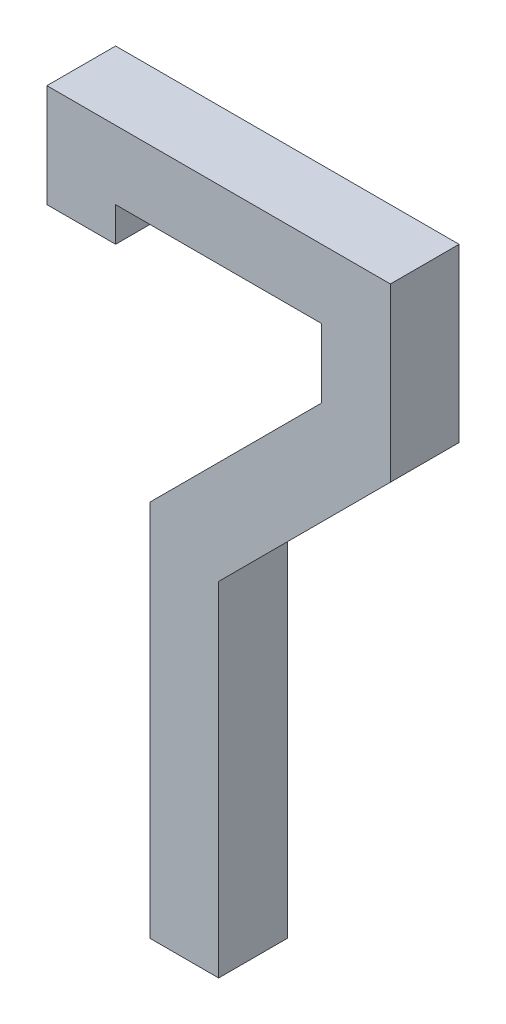
ISO-10303-21;
HEADER;
FILE_DESCRIPTION(('STEP AP214'),'2;1');
FILE_NAME('part.step','',(''),(''),'','','');
FILE_SCHEMA(('AUTOMOTIVE_DESIGN { 1 0 10303 214 1 1 1 1 }'));
ENDSEC;
DATA;
#1=APPLICATION_CONTEXT('core data for automotive mechanical design processes');
#2=APPLICATION_PROTOCOL_DEFINITION('international standard','automotive_design',2000,#1);
#3=PRODUCT_CONTEXT('',#1,'mechanical');
#4=PRODUCT('Part','Part','',(#3));
#5=PRODUCT_RELATED_PRODUCT_CATEGORY('part','',(#4));
#6=PRODUCT_DEFINITION_FORMATION('','',#4);
#7=PRODUCT_DEFINITION_CONTEXT('part definition',#1,'design');
#8=PRODUCT_DEFINITION('design','',#6,#7);
#9=PRODUCT_DEFINITION_SHAPE('','',#8);
#10=(LENGTH_UNIT() NAMED_UNIT(*) SI_UNIT(.MILLI.,.METRE.));
#11=(NAMED_UNIT(*) PLANE_ANGLE_UNIT() SI_UNIT($,.RADIAN.));
#12=(NAMED_UNIT(*) SI_UNIT($,.STERADIAN.) SOLID_ANGLE_UNIT());
#13=UNCERTAINTY_MEASURE_WITH_UNIT(LENGTH_MEASURE(1.E-05),#10,'distance_accuracy_value','');
#14=(GEOMETRIC_REPRESENTATION_CONTEXT(3) GLOBAL_UNCERTAINTY_ASSIGNED_CONTEXT((#13)) GLOBAL_UNIT_ASSIGNED_CONTEXT((#10,
#11,#12)) REPRESENTATION_CONTEXT('',''));
#15=CARTESIAN_POINT('',(0.,0.,0.));
#16=DIRECTION('',(0.,0.,1.));
#17=DIRECTION('',(1.,0.,0.));
#18=AXIS2_PLACEMENT_3D('',#15,#16,#17);
#19=CARTESIAN_POINT('',(-0.06349999999999,0.127,0.0254));
#20=DIRECTION('',(0.,0.,1.));
#21=DIRECTION('',(1.,0.,0.));
#22=AXIS2_PLACEMENT_3D('',#19,#20,#21);
#23=PLANE('',#22);
#24=DIRECTION('',(0.,1.,0.));
#25=VECTOR('',#24,1.);
#26=CARTESIAN_POINT('',(0.0635,0.127,0.0254));
#27=LINE('',#26,#25);
#28=CARTESIAN_POINT('',(0.0635,0.127,0.0254));
#29=VERTEX_POINT('',#28);
#30=CARTESIAN_POINT('',(0.0635,0.0635,0.0254));
#31=VERTEX_POINT('',#30);
#32=EDGE_CURVE('E157',#29,#31,#27,.F.);
#33=ORIENTED_EDGE('',*,*,#32,.F.);
#34=DIRECTION('',(1.,0.,0.));
#35=VECTOR('',#34,1.);
#36=CARTESIAN_POINT('',(-0.06349999999999,0.127,0.0254));
#37=LINE('',#36,#35);
#38=CARTESIAN_POINT('',(-0.06349999999999,0.127,0.0254));
#39=VERTEX_POINT('',#38);
#40=EDGE_CURVE('E118',#39,#29,#37,.T.);
#41=ORIENTED_EDGE('',*,*,#40,.F.);
#42=DIRECTION('',(0.,1.,0.));
#43=VECTOR('',#42,1.);
#44=CARTESIAN_POINT('',(-0.06349999999999,0.0889,0.0254));
#45=LINE('',#44,#43);
#46=CARTESIAN_POINT('',(-0.06349999999999,0.0889,0.0254));
#47=VERTEX_POINT('',#46);
#48=EDGE_CURVE('E20',#47,#39,#45,.T.);
#49=ORIENTED_EDGE('',*,*,#48,.F.);
#50=DIRECTION('',(1.,0.,0.));
#51=VECTOR('',#50,1.);
#52=CARTESIAN_POINT('',(-0.0381,0.0889,0.0254));
#53=LINE('',#52,#51);
#54=CARTESIAN_POINT('',(-0.0381,0.0889,0.0254));
#55=VERTEX_POINT('',#54);
#56=EDGE_CURVE('E107',#55,#47,#53,.F.);
#57=ORIENTED_EDGE('',*,*,#56,.F.);
#58=DIRECTION('',(0.,1.,0.));
#59=VECTOR('',#58,1.);
#60=CARTESIAN_POINT('',(-0.0381,0.1016,0.0254));
#61=LINE('',#60,#59);
#62=CARTESIAN_POINT('',(-0.0381,0.1016,0.0254));
#63=VERTEX_POINT('',#62);
#64=EDGE_CURVE('E102',#63,#55,#61,.F.);
#65=ORIENTED_EDGE('',*,*,#64,.F.);
#66=DIRECTION('',(1.,0.,0.));
#67=VECTOR('',#66,1.);
#68=CARTESIAN_POINT('',(0.0381,0.1016,0.0254));
#69=LINE('',#68,#67);
#70=CARTESIAN_POINT('',(0.0381,0.1016,0.0254));
#71=VERTEX_POINT('',#70);
#72=EDGE_CURVE('E129',#71,#63,#69,.F.);
#73=ORIENTED_EDGE('',*,*,#72,.F.);
#74=DIRECTION('',(0.,1.,0.));
#75=VECTOR('',#74,1.);
#76=CARTESIAN_POINT('',(0.0381,0.0762,0.0254));
#77=LINE('',#76,#75);
#78=CARTESIAN_POINT('',(0.03809999999999,0.07620000000001,0.0254));
#79=VERTEX_POINT('',#78);
#80=EDGE_CURVE('E133',#79,#71,#77,.T.);
#81=ORIENTED_EDGE('',*,*,#80,.F.);
#82=DIRECTION('',(-0.707106781186048,-0.707106781187048,0.));
#83=VECTOR('',#82,1.);
#84=CARTESIAN_POINT('',(-0.02539999999999,0.0127,0.0254));
#85=LINE('',#84,#83);
#86=CARTESIAN_POINT('',(-0.02539999999999,0.0127,0.0254));
#87=VERTEX_POINT('',#86);
#88=EDGE_CURVE('E137',#87,#79,#85,.F.);
#89=ORIENTED_EDGE('',*,*,#88,.F.);
#90=DIRECTION('',(0.,1.,0.));
#91=VECTOR('',#90,1.);
#92=CARTESIAN_POINT('',(-0.02539999999999,-0.127,0.0254));
#93=LINE('',#92,#91);
#94=CARTESIAN_POINT('',(-0.02539999999999,-0.127,0.0254));
#95=VERTEX_POINT('',#94);
#96=EDGE_CURVE('E141',#95,#87,#93,.T.);
#97=ORIENTED_EDGE('',*,*,#96,.F.);
#98=DIRECTION('',(1.,0.,0.));
#99=VECTOR('',#98,1.);
#100=CARTESIAN_POINT('',(0.,-0.127,0.0254));
#101=LINE('',#100,#99);
#102=CARTESIAN_POINT('',(0.,-0.127,0.0254));
#103=VERTEX_POINT('',#102);
#104=EDGE_CURVE('E145',#103,#95,#101,.F.);
#105=ORIENTED_EDGE('',*,*,#104,.F.);
#106=DIRECTION('',(0.,1.,0.));
#107=VECTOR('',#106,1.);
#108=CARTESIAN_POINT('',(0.,0.,0.0254));
#109=LINE('',#108,#107);
#110=CARTESIAN_POINT('',(0.,0.,0.0254));
#111=VERTEX_POINT('',#110);
#112=EDGE_CURVE('E149',#111,#103,#109,.F.);
#113=ORIENTED_EDGE('',*,*,#112,.F.);
#114=DIRECTION('',(0.707106781186548,0.707106781186548,0.));
#115=VECTOR('',#114,1.);
#116=CARTESIAN_POINT('',(0.0635,0.0635,0.0254));
#117=LINE('',#116,#115);
#118=EDGE_CURVE('E153',#31,#111,#117,.F.);
#119=ORIENTED_EDGE('',*,*,#118,.F.);
#120=EDGE_LOOP('',(#33,#41,#49,#57,#65,#73,#81,#89,#97,#105,#113,#119));
#121=FACE_BOUND('',#120,.T.);
#122=ADVANCED_FACE('F17',(#121),#23,.T.);
#123=CARTESIAN_POINT('',(-0.06349999999999,0.0889,0.));
#124=DIRECTION('',(-1.,0.,0.));
#125=DIRECTION('',(0.,0.,1.));
#126=AXIS2_PLACEMENT_3D('',#123,#124,#125);
#127=PLANE('',#126);
#128=DIRECTION('',(0.,0.,1.));
#129=VECTOR('',#128,1.);
#130=CARTESIAN_POINT('',(-0.06349999999999,0.127,0.));
#131=LINE('',#130,#129);
#132=CARTESIAN_POINT('',(-0.06349999999999,0.127,0.));
#133=VERTEX_POINT('',#132);
#134=EDGE_CURVE('E161',#133,#39,#131,.T.);
#135=ORIENTED_EDGE('',*,*,#134,.F.);
#136=DIRECTION('',(0.,1.,0.));
#137=VECTOR('',#136,1.);
#138=CARTESIAN_POINT('',(-0.06349999999999,0.127,0.));
#139=LINE('',#138,#137);
#140=CARTESIAN_POINT('',(-0.06349999999999,0.0889,0.));
#141=VERTEX_POINT('',#140);
#142=EDGE_CURVE('E124',#133,#141,#139,.F.);
#143=ORIENTED_EDGE('',*,*,#142,.T.);
#144=DIRECTION('',(0.,0.,-1.));
#145=VECTOR('',#144,1.);
#146=CARTESIAN_POINT('',(-0.06349999999999,0.0889,0.));
#147=LINE('',#146,#145);
#148=EDGE_CURVE('E112',#47,#141,#147,.T.);
#149=ORIENTED_EDGE('',*,*,#148,.F.);
#150=ORIENTED_EDGE('',*,*,#48,.T.);
#151=EDGE_LOOP('',(#135,#143,#149,#150));
#152=FACE_BOUND('',#151,.T.);
#153=ADVANCED_FACE('F123',(#152),#127,.T.);
#154=CARTESIAN_POINT('',(-0.0381,0.0889,0.));
#155=DIRECTION('',(0.,-1.,0.));
#156=DIRECTION('',(0.,0.,-1.));
#157=AXIS2_PLACEMENT_3D('',#154,#155,#156);
#158=PLANE('',#157);
#159=ORIENTED_EDGE('',*,*,#148,.T.);
#160=DIRECTION('',(1.,0.,0.));
#161=VECTOR('',#160,1.);
#162=CARTESIAN_POINT('',(-0.06349999999999,0.0889,0.));
#163=LINE('',#162,#161);
#164=CARTESIAN_POINT('',(-0.0381,0.0889,0.));
#165=VERTEX_POINT('',#164);
#166=EDGE_CURVE('E166',#141,#165,#163,.T.);
#167=ORIENTED_EDGE('',*,*,#166,.T.);
#168=DIRECTION('',(0.,0.,-1.));
#169=VECTOR('',#168,1.);
#170=CARTESIAN_POINT('',(-0.0381,0.0889,0.));
#171=LINE('',#170,#169);
#172=EDGE_CURVE('E114',#55,#165,#171,.T.);
#173=ORIENTED_EDGE('',*,*,#172,.F.);
#174=ORIENTED_EDGE('',*,*,#56,.T.);
#175=EDGE_LOOP('',(#159,#167,#173,#174));
#176=FACE_BOUND('',#175,.T.);
#177=ADVANCED_FACE('F109',(#176),#158,.T.);
#178=CARTESIAN_POINT('',(-0.0381,0.1016,0.));
#179=DIRECTION('',(1.,0.,0.));
#180=DIRECTION('',(0.,0.,-1.));
#181=AXIS2_PLACEMENT_3D('',#178,#179,#180);
#182=PLANE('',#181);
#183=ORIENTED_EDGE('',*,*,#172,.T.);
#184=DIRECTION('',(0.,1.,0.));
#185=VECTOR('',#184,1.);
#186=CARTESIAN_POINT('',(-0.0381,0.127,0.));
#187=LINE('',#186,#185);
#188=CARTESIAN_POINT('',(-0.0381,0.1016,0.));
#189=VERTEX_POINT('',#188);
#190=EDGE_CURVE('E168',#165,#189,#187,.T.);
#191=ORIENTED_EDGE('',*,*,#190,.T.);
#192=DIRECTION('',(0.,0.,-1.));
#193=VECTOR('',#192,1.);
#194=CARTESIAN_POINT('',(-0.0381,0.1016,0.));
#195=LINE('',#194,#193);
#196=EDGE_CURVE('E131',#63,#189,#195,.T.);
#197=ORIENTED_EDGE('',*,*,#196,.F.);
#198=ORIENTED_EDGE('',*,*,#64,.T.);
#199=EDGE_LOOP('',(#183,#191,#197,#198));
#200=FACE_BOUND('',#199,.T.);
#201=ADVANCED_FACE('F234',(#200),#182,.T.);
#202=CARTESIAN_POINT('',(0.0381,0.1016,0.));
#203=DIRECTION('',(0.,-1.,0.));
#204=DIRECTION('',(0.,0.,-1.));
#205=AXIS2_PLACEMENT_3D('',#202,#203,#204);
#206=PLANE('',#205);
#207=ORIENTED_EDGE('',*,*,#196,.T.);
#208=DIRECTION('',(1.,0.,0.));
#209=VECTOR('',#208,1.);
#210=CARTESIAN_POINT('',(-0.06349999999999,0.1016,0.));
#211=LINE('',#210,#209);
#212=CARTESIAN_POINT('',(0.0381,0.1016,0.));
#213=VERTEX_POINT('',#212);
#214=EDGE_CURVE('E171',#189,#213,#211,.T.);
#215=ORIENTED_EDGE('',*,*,#214,.T.);
#216=DIRECTION('',(0.,0.,1.));
#217=VECTOR('',#216,1.);
#218=CARTESIAN_POINT('',(0.0381,0.1016,0.));
#219=LINE('',#218,#217);
#220=EDGE_CURVE('E135',#71,#213,#219,.F.);
#221=ORIENTED_EDGE('',*,*,#220,.F.);
#222=ORIENTED_EDGE('',*,*,#72,.T.);
#223=EDGE_LOOP('',(#207,#215,#221,#222));
#224=FACE_BOUND('',#223,.T.);
#225=ADVANCED_FACE('F233',(#224),#206,.T.);
#226=CARTESIAN_POINT('',(0.0381,0.0762,0.));
#227=DIRECTION('',(-1.,0.,0.));
#228=DIRECTION('',(0.,0.,1.));
#229=AXIS2_PLACEMENT_3D('',#226,#227,#228);
#230=PLANE('',#229);
#231=ORIENTED_EDGE('',*,*,#220,.T.);
#232=DIRECTION('',(0.,1.,0.));
#233=VECTOR('',#232,1.);
#234=CARTESIAN_POINT('',(0.0381,0.127,0.));
#235=LINE('',#234,#233);
#236=CARTESIAN_POINT('',(0.03809999999999,0.07620000000001,0.));
#237=VERTEX_POINT('',#236);
#238=EDGE_CURVE('E174',#213,#237,#235,.F.);
#239=ORIENTED_EDGE('',*,*,#238,.T.);
#240=DIRECTION('',(0.,0.,1.));
#241=VECTOR('',#240,1.);
#242=CARTESIAN_POINT('',(0.0380999999999601,0.0762000000000399,0.));
#243=LINE('',#242,#241);
#244=EDGE_CURVE('E139',#79,#237,#243,.F.);
#245=ORIENTED_EDGE('',*,*,#244,.F.);
#246=ORIENTED_EDGE('',*,*,#80,.T.);
#247=EDGE_LOOP('',(#231,#239,#245,#246));
#248=FACE_BOUND('',#247,.T.);
#249=ADVANCED_FACE('F227',(#248),#230,.T.);
#250=CARTESIAN_POINT('',(-0.02539999999999,0.0127,0.));
#251=DIRECTION('',(-0.707106781187048,0.707106781186048,0.));
#252=DIRECTION('',(-0.707106781186048,-0.707106781187048,0.));
#253=AXIS2_PLACEMENT_3D('',#250,#251,#252);
#254=PLANE('',#253);
#255=ORIENTED_EDGE('',*,*,#244,.T.);
#256=DIRECTION('',(-0.707106781186492,-0.707106781186603,0.));
#257=VECTOR('',#256,1.);
#258=CARTESIAN_POINT('',(0.0381,0.0762,0.));
#259=LINE('',#258,#257);
#260=CARTESIAN_POINT('',(-0.02539999999999,0.0127,0.));
#261=VERTEX_POINT('',#260);
#262=EDGE_CURVE('E177',#237,#261,#259,.T.);
#263=ORIENTED_EDGE('',*,*,#262,.T.);
#264=DIRECTION('',(0.,0.,1.));
#265=VECTOR('',#264,1.);
#266=CARTESIAN_POINT('',(-0.02539999999999,0.0127,0.));
#267=LINE('',#266,#265);
#268=EDGE_CURVE('E143',#87,#261,#267,.F.);
#269=ORIENTED_EDGE('',*,*,#268,.F.);
#270=ORIENTED_EDGE('',*,*,#88,.T.);
#271=EDGE_LOOP('',(#255,#263,#269,#270));
#272=FACE_BOUND('',#271,.T.);
#273=ADVANCED_FACE('F223',(#272),#254,.T.);
#274=CARTESIAN_POINT('',(-0.02539999999999,-0.127,0.));
#275=DIRECTION('',(-1.,0.,0.));
#276=DIRECTION('',(0.,0.,1.));
#277=AXIS2_PLACEMENT_3D('',#274,#275,#276);
#278=PLANE('',#277);
#279=ORIENTED_EDGE('',*,*,#268,.T.);
#280=DIRECTION('',(0.,1.,0.));
#281=VECTOR('',#280,1.);
#282=CARTESIAN_POINT('',(-0.02539999999999,0.127,0.));
#283=LINE('',#282,#281);
#284=CARTESIAN_POINT('',(-0.02539999999999,-0.127,0.));
#285=VERTEX_POINT('',#284);
#286=EDGE_CURVE('E180',#261,#285,#283,.F.);
#287=ORIENTED_EDGE('',*,*,#286,.T.);
#288=DIRECTION('',(0.,0.,-1.));
#289=VECTOR('',#288,1.);
#290=CARTESIAN_POINT('',(-0.02539999999999,-0.127,0.));
#291=LINE('',#290,#289);
#292=EDGE_CURVE('E147',#95,#285,#291,.T.);
#293=ORIENTED_EDGE('',*,*,#292,.F.);
#294=ORIENTED_EDGE('',*,*,#96,.T.);
#295=EDGE_LOOP('',(#279,#287,#293,#294));
#296=FACE_BOUND('',#295,.T.);
#297=ADVANCED_FACE('F217',(#296),#278,.T.);
#298=CARTESIAN_POINT('',(0.,-0.127,0.));
#299=DIRECTION('',(0.,-1.,0.));
#300=DIRECTION('',(0.,0.,-1.));
#301=AXIS2_PLACEMENT_3D('',#298,#299,#300);
#302=PLANE('',#301);
#303=ORIENTED_EDGE('',*,*,#292,.T.);
#304=DIRECTION('',(1.,0.,0.));
#305=VECTOR('',#304,1.);
#306=CARTESIAN_POINT('',(-0.06349999999999,-0.127,0.));
#307=LINE('',#306,#305);
#308=CARTESIAN_POINT('',(0.,-0.127,0.));
#309=VERTEX_POINT('',#308);
#310=EDGE_CURVE('E183',#285,#309,#307,.T.);
#311=ORIENTED_EDGE('',*,*,#310,.T.);
#312=DIRECTION('',(0.,0.,-1.));
#313=VECTOR('',#312,1.);
#314=CARTESIAN_POINT('',(0.,-0.127,0.));
#315=LINE('',#314,#313);
#316=EDGE_CURVE('E151',#103,#309,#315,.T.);
#317=ORIENTED_EDGE('',*,*,#316,.F.);
#318=ORIENTED_EDGE('',*,*,#104,.T.);
#319=EDGE_LOOP('',(#303,#311,#317,#318));
#320=FACE_BOUND('',#319,.T.);
#321=ADVANCED_FACE('F213',(#320),#302,.T.);
#322=CARTESIAN_POINT('',(0.,0.,0.));
#323=DIRECTION('',(1.,0.,0.));
#324=DIRECTION('',(0.,0.,-1.));
#325=AXIS2_PLACEMENT_3D('',#322,#323,#324);
#326=PLANE('',#325);
#327=ORIENTED_EDGE('',*,*,#316,.T.);
#328=DIRECTION('',(0.,1.,0.));
#329=VECTOR('',#328,1.);
#330=CARTESIAN_POINT('',(0.,0.127,0.));
#331=LINE('',#330,#329);
#332=CARTESIAN_POINT('',(0.,0.,0.));
#333=VERTEX_POINT('',#332);
#334=EDGE_CURVE('E186',#309,#333,#331,.T.);
#335=ORIENTED_EDGE('',*,*,#334,.T.);
#336=DIRECTION('',(0.,0.,1.));
#337=VECTOR('',#336,1.);
#338=CARTESIAN_POINT('',(0.,0.,0.));
#339=LINE('',#338,#337);
#340=EDGE_CURVE('E155',#111,#333,#339,.F.);
#341=ORIENTED_EDGE('',*,*,#340,.F.);
#342=ORIENTED_EDGE('',*,*,#112,.T.);
#343=EDGE_LOOP('',(#327,#335,#341,#342));
#344=FACE_BOUND('',#343,.T.);
#345=ADVANCED_FACE('F207',(#344),#326,.T.);
#346=CARTESIAN_POINT('',(0.0635,0.0635,0.));
#347=DIRECTION('',(0.707106781186548,-0.707106781186548,0.));
#348=DIRECTION('',(0.707106781186548,0.707106781186548,0.));
#349=AXIS2_PLACEMENT_3D('',#346,#347,#348);
#350=PLANE('',#349);
#351=ORIENTED_EDGE('',*,*,#340,.T.);
#352=DIRECTION('',(0.707106781186548,0.707106781186548,0.));
#353=VECTOR('',#352,1.);
#354=CARTESIAN_POINT('',(0.,0.,0.));
#355=LINE('',#354,#353);
#356=CARTESIAN_POINT('',(0.0635,0.0635,0.));
#357=VERTEX_POINT('',#356);
#358=EDGE_CURVE('E189',#333,#357,#355,.T.);
#359=ORIENTED_EDGE('',*,*,#358,.T.);
#360=DIRECTION('',(0.,0.,-1.));
#361=VECTOR('',#360,1.);
#362=CARTESIAN_POINT('',(0.0635,0.0635,0.));
#363=LINE('',#362,#361);
#364=EDGE_CURVE('E159',#31,#357,#363,.T.);
#365=ORIENTED_EDGE('',*,*,#364,.F.);
#366=ORIENTED_EDGE('',*,*,#118,.T.);
#367=EDGE_LOOP('',(#351,#359,#365,#366));
#368=FACE_BOUND('',#367,.T.);
#369=ADVANCED_FACE('F202',(#368),#350,.T.);
#370=CARTESIAN_POINT('',(0.0635,0.127,0.));
#371=DIRECTION('',(1.,0.,0.));
#372=DIRECTION('',(0.,0.,-1.));
#373=AXIS2_PLACEMENT_3D('',#370,#371,#372);
#374=PLANE('',#373);
#375=ORIENTED_EDGE('',*,*,#364,.T.);
#376=DIRECTION('',(0.,1.,0.));
#377=VECTOR('',#376,1.);
#378=CARTESIAN_POINT('',(0.0635,0.127,0.));
#379=LINE('',#378,#377);
#380=CARTESIAN_POINT('',(0.0635,0.127,0.));
#381=VERTEX_POINT('',#380);
#382=EDGE_CURVE('E26',#357,#381,#379,.T.);
#383=ORIENTED_EDGE('',*,*,#382,.T.);
#384=DIRECTION('',(0.,0.,1.));
#385=VECTOR('',#384,1.);
#386=CARTESIAN_POINT('',(0.0635,0.127,0.));
#387=LINE('',#386,#385);
#388=EDGE_CURVE('E34',#29,#381,#387,.F.);
#389=ORIENTED_EDGE('',*,*,#388,.F.);
#390=ORIENTED_EDGE('',*,*,#32,.T.);
#391=EDGE_LOOP('',(#375,#383,#389,#390));
#392=FACE_BOUND('',#391,.T.);
#393=ADVANCED_FACE('F195',(#392),#374,.T.);
#394=CARTESIAN_POINT('',(-0.06349999999999,0.127,0.));
#395=DIRECTION('',(0.,1.,0.));
#396=DIRECTION('',(0.,0.,1.));
#397=AXIS2_PLACEMENT_3D('',#394,#395,#396);
#398=PLANE('',#397);
#399=ORIENTED_EDGE('',*,*,#388,.T.);
#400=DIRECTION('',(1.,0.,0.));
#401=VECTOR('',#400,1.);
#402=CARTESIAN_POINT('',(-0.06349999999999,0.127,0.));
#403=LINE('',#402,#401);
#404=EDGE_CURVE('E11',#381,#133,#403,.F.);
#405=ORIENTED_EDGE('',*,*,#404,.T.);
#406=ORIENTED_EDGE('',*,*,#134,.T.);
#407=ORIENTED_EDGE('',*,*,#40,.T.);
#408=EDGE_LOOP('',(#399,#405,#406,#407));
#409=FACE_BOUND('',#408,.T.);
#410=ADVANCED_FACE('F235',(#409),#398,.T.);
#411=CARTESIAN_POINT('',(-0.06349999999999,0.127,0.));
#412=DIRECTION('',(0.,0.,1.));
#413=DIRECTION('',(1.,0.,0.));
#414=AXIS2_PLACEMENT_3D('',#411,#412,#413);
#415=PLANE('',#414);
#416=ORIENTED_EDGE('',*,*,#382,.F.);
#417=ORIENTED_EDGE('',*,*,#358,.F.);
#418=ORIENTED_EDGE('',*,*,#334,.F.);
#419=ORIENTED_EDGE('',*,*,#310,.F.);
#420=ORIENTED_EDGE('',*,*,#286,.F.);
#421=ORIENTED_EDGE('',*,*,#262,.F.);
#422=ORIENTED_EDGE('',*,*,#238,.F.);
#423=ORIENTED_EDGE('',*,*,#214,.F.);
#424=ORIENTED_EDGE('',*,*,#190,.F.);
#425=ORIENTED_EDGE('',*,*,#166,.F.);
#426=ORIENTED_EDGE('',*,*,#142,.F.);
#427=ORIENTED_EDGE('',*,*,#404,.F.);
#428=EDGE_LOOP('',(#416,#417,#418,#419,#420,#421,#422,#423,#424,#425,#426,#427));
#429=FACE_BOUND('',#428,.T.);
#430=ADVANCED_FACE('F199',(#429),#415,.F.);
#431=CLOSED_SHELL('',(#122,#153,#177,#201,#225,#249,#273,#297,#321,#345,#369,#393,#410,#430));
#432=MANIFOLD_SOLID_BREP('B1',#431);
#433=ADVANCED_BREP_SHAPE_REPRESENTATION('',(#18,#432),#14);
#434=SHAPE_DEFINITION_REPRESENTATION(#9,#433);
ENDSEC;
END-ISO-10303-21;
